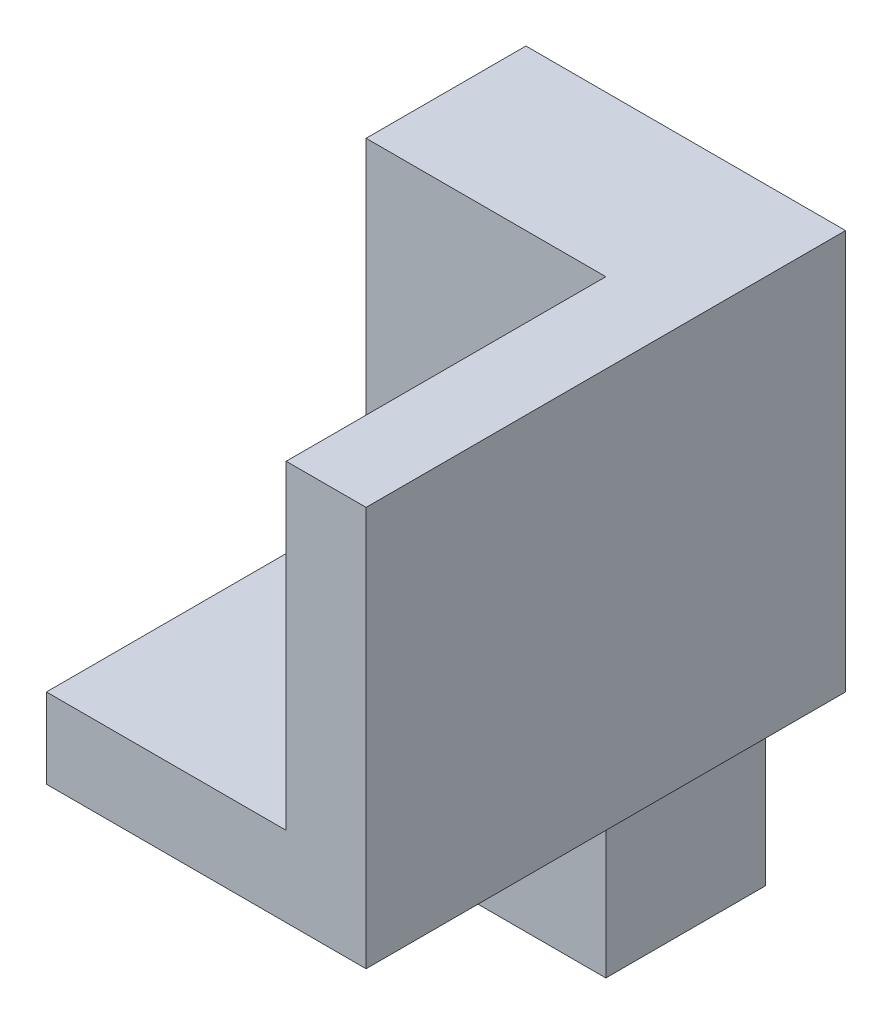
ISO-10303-21;
HEADER;
FILE_DESCRIPTION(('STEP AP214'),'2;1');
FILE_NAME('part.step','',(''),(''),'','','');
FILE_SCHEMA(('AUTOMOTIVE_DESIGN { 1 0 10303 214 1 1 1 1 }'));
ENDSEC;
DATA;
#1=APPLICATION_CONTEXT('core data for automotive mechanical design processes');
#2=APPLICATION_PROTOCOL_DEFINITION('international standard','automotive_design',2000,#1);
#3=PRODUCT_CONTEXT('',#1,'mechanical');
#4=PRODUCT('Part','Part','',(#3));
#5=PRODUCT_RELATED_PRODUCT_CATEGORY('part','',(#4));
#6=PRODUCT_DEFINITION_FORMATION('','',#4);
#7=PRODUCT_DEFINITION_CONTEXT('part definition',#1,'design');
#8=PRODUCT_DEFINITION('design','',#6,#7);
#9=PRODUCT_DEFINITION_SHAPE('','',#8);
#10=(LENGTH_UNIT() NAMED_UNIT(*) SI_UNIT(.MILLI.,.METRE.));
#11=(NAMED_UNIT(*) PLANE_ANGLE_UNIT() SI_UNIT($,.RADIAN.));
#12=(NAMED_UNIT(*) SI_UNIT($,.STERADIAN.) SOLID_ANGLE_UNIT());
#13=UNCERTAINTY_MEASURE_WITH_UNIT(LENGTH_MEASURE(1.E-05),#10,'distance_accuracy_value','');
#14=(GEOMETRIC_REPRESENTATION_CONTEXT(3) GLOBAL_UNCERTAINTY_ASSIGNED_CONTEXT((#13)) GLOBAL_UNIT_ASSIGNED_CONTEXT((#10,
#11,#12)) REPRESENTATION_CONTEXT('',''));
#15=CARTESIAN_POINT('',(0.,0.,0.));
#16=DIRECTION('',(0.,0.,1.));
#17=DIRECTION('',(1.,0.,0.));
#18=AXIS2_PLACEMENT_3D('',#15,#16,#17);
#19=CARTESIAN_POINT('',(0.,0.,0.));
#20=DIRECTION('',(1.,0.,0.));
#21=DIRECTION('',(0.,0.,-1.));
#22=AXIS2_PLACEMENT_3D('',#19,#20,#21);
#23=PLANE('',#22);
#24=DIRECTION('',(0.,0.,1.));
#25=VECTOR('',#24,1.);
#26=CARTESIAN_POINT('',(0.,-25.,30.));
#27=LINE('',#26,#25);
#28=CARTESIAN_POINT('',(0.,-25.,0.));
#29=VERTEX_POINT('',#28);
#30=CARTESIAN_POINT('',(0.,-25.,10.));
#31=VERTEX_POINT('',#30);
#32=EDGE_CURVE('E120',#29,#31,#27,.T.);
#33=ORIENTED_EDGE('',*,*,#32,.F.);
#34=DIRECTION('',(0.,1.,0.));
#35=VECTOR('',#34,1.);
#36=CARTESIAN_POINT('',(0.,-38.,0.));
#37=LINE('',#36,#35);
#38=CARTESIAN_POINT('',(0.,-38.,0.));
#39=VERTEX_POINT('',#38);
#40=EDGE_CURVE('E138',#39,#29,#37,.T.);
#41=ORIENTED_EDGE('',*,*,#40,.F.);
#42=DIRECTION('',(0.,0.,-1.));
#43=VECTOR('',#42,1.);
#44=CARTESIAN_POINT('',(0.,-38.,10.));
#45=LINE('',#44,#43);
#46=CARTESIAN_POINT('',(0.,-38.,10.));
#47=VERTEX_POINT('',#46);
#48=EDGE_CURVE('E85',#47,#39,#45,.T.);
#49=ORIENTED_EDGE('',*,*,#48,.F.);
#50=DIRECTION('',(0.,-1.,0.));
#51=VECTOR('',#50,1.);
#52=CARTESIAN_POINT('',(0.,-25.,10.));
#53=LINE('',#52,#51);
#54=EDGE_CURVE('E79',#31,#47,#53,.T.);
#55=ORIENTED_EDGE('',*,*,#54,.F.);
#56=EDGE_LOOP('',(#33,#41,#49,#55));
#57=FACE_BOUND('',#56,.T.);
#58=ADVANCED_FACE('F45',(#57),#23,.F.);
#59=CARTESIAN_POINT('',(10.,-38.,0.));
#60=DIRECTION('',(0.,0.,1.));
#61=DIRECTION('',(1.,0.,0.));
#62=AXIS2_PLACEMENT_3D('',#59,#60,#61);
#63=PLANE('',#62);
#64=ORIENTED_EDGE('',*,*,#40,.T.);
#65=DIRECTION('',(1.,0.,0.));
#66=VECTOR('',#65,1.);
#67=CARTESIAN_POINT('',(-5.,-25.,0.));
#68=LINE('',#67,#66);
#69=CARTESIAN_POINT('',(-5.,-25.,0.));
#70=VERTEX_POINT('',#69);
#71=EDGE_CURVE('E142',#70,#29,#68,.T.);
#72=ORIENTED_EDGE('',*,*,#71,.F.);
#73=DIRECTION('',(0.,-1.,0.));
#74=VECTOR('',#73,1.);
#75=CARTESIAN_POINT('',(-5.,-25.,0.));
#76=LINE('',#75,#74);
#77=CARTESIAN_POINT('',(-5.,0.,0.));
#78=VERTEX_POINT('',#77);
#79=EDGE_CURVE('E185',#78,#70,#76,.T.);
#80=ORIENTED_EDGE('',*,*,#79,.F.);
#81=DIRECTION('',(-1.,0.,0.));
#82=VECTOR('',#81,1.);
#83=CARTESIAN_POINT('',(10.,0.,0.));
#84=LINE('',#83,#82);
#85=CARTESIAN_POINT('',(15.,0.,0.));
#86=VERTEX_POINT('',#85);
#87=EDGE_CURVE('E49',#86,#78,#84,.T.);
#88=ORIENTED_EDGE('',*,*,#87,.F.);
#89=DIRECTION('',(0.,1.,0.));
#90=VECTOR('',#89,1.);
#91=CARTESIAN_POINT('',(15.,0.,0.));
#92=LINE('',#91,#90);
#93=CARTESIAN_POINT('',(15.,-25.,0.));
#94=VERTEX_POINT('',#93);
#95=EDGE_CURVE('E259',#94,#86,#92,.T.);
#96=ORIENTED_EDGE('',*,*,#95,.F.);
#97=DIRECTION('',(-1.,0.,0.));
#98=VECTOR('',#97,1.);
#99=CARTESIAN_POINT('',(15.,-25.,0.));
#100=LINE('',#99,#98);
#101=CARTESIAN_POINT('',(10.,-25.,0.));
#102=VERTEX_POINT('',#101);
#103=EDGE_CURVE('E263',#94,#102,#100,.T.);
#104=ORIENTED_EDGE('',*,*,#103,.T.);
#105=DIRECTION('',(0.,1.,0.));
#106=VECTOR('',#105,1.);
#107=CARTESIAN_POINT('',(10.,-38.,0.));
#108=LINE('',#107,#106);
#109=CARTESIAN_POINT('',(10.,-38.,0.));
#110=VERTEX_POINT('',#109);
#111=EDGE_CURVE('E111',#110,#102,#108,.T.);
#112=ORIENTED_EDGE('',*,*,#111,.F.);
#113=DIRECTION('',(-1.,0.,0.));
#114=VECTOR('',#113,1.);
#115=CARTESIAN_POINT('',(10.,-38.,0.));
#116=LINE('',#115,#114);
#117=EDGE_CURVE('E131',#110,#39,#116,.T.);
#118=ORIENTED_EDGE('',*,*,#117,.T.);
#119=EDGE_LOOP('',(#64,#72,#80,#88,#96,#104,#112,#118));
#120=FACE_BOUND('',#119,.T.);
#121=ADVANCED_FACE('F47',(#120),#63,.F.);
#122=CARTESIAN_POINT('',(10.,0.,0.));
#123=DIRECTION('',(0.,-1.,0.));
#124=DIRECTION('',(0.,0.,-1.));
#125=AXIS2_PLACEMENT_3D('',#122,#123,#124);
#126=PLANE('',#125);
#127=ORIENTED_EDGE('',*,*,#87,.T.);
#128=DIRECTION('',(0.,0.,-1.));
#129=VECTOR('',#128,1.);
#130=CARTESIAN_POINT('',(-5.,0.,0.));
#131=LINE('',#130,#129);
#132=CARTESIAN_POINT('',(-5.,0.,10.));
#133=VERTEX_POINT('',#132);
#134=EDGE_CURVE('E171',#133,#78,#131,.T.);
#135=ORIENTED_EDGE('',*,*,#134,.F.);
#136=DIRECTION('',(-1.,0.,0.));
#137=VECTOR('',#136,1.);
#138=CARTESIAN_POINT('',(10.,0.,10.));
#139=LINE('',#138,#137);
#140=CARTESIAN_POINT('',(10.,0.,10.));
#141=VERTEX_POINT('',#140);
#142=EDGE_CURVE('E94',#141,#133,#139,.T.);
#143=ORIENTED_EDGE('',*,*,#142,.F.);
#144=DIRECTION('',(0.,0.,1.));
#145=VECTOR('',#144,1.);
#146=CARTESIAN_POINT('',(10.,0.,0.));
#147=LINE('',#146,#145);
#148=CARTESIAN_POINT('',(10.,0.,30.));
#149=VERTEX_POINT('',#148);
#150=EDGE_CURVE('E222',#141,#149,#147,.T.);
#151=ORIENTED_EDGE('',*,*,#150,.T.);
#152=DIRECTION('',(-1.,0.,0.));
#153=VECTOR('',#152,1.);
#154=CARTESIAN_POINT('',(15.,0.,30.));
#155=LINE('',#154,#153);
#156=CARTESIAN_POINT('',(15.,0.,30.));
#157=VERTEX_POINT('',#156);
#158=EDGE_CURVE('E198',#157,#149,#155,.T.);
#159=ORIENTED_EDGE('',*,*,#158,.F.);
#160=DIRECTION('',(0.,0.,1.));
#161=VECTOR('',#160,1.);
#162=CARTESIAN_POINT('',(15.,0.,0.));
#163=LINE('',#162,#161);
#164=EDGE_CURVE('E175',#86,#157,#163,.T.);
#165=ORIENTED_EDGE('',*,*,#164,.F.);
#166=EDGE_LOOP('',(#127,#135,#143,#151,#159,#165));
#167=FACE_BOUND('',#166,.T.);
#168=ADVANCED_FACE('F170',(#167),#126,.F.);
#169=CARTESIAN_POINT('',(10.,0.,10.));
#170=DIRECTION('',(0.,0.,-1.));
#171=DIRECTION('',(0.,1.,0.));
#172=AXIS2_PLACEMENT_3D('',#169,#170,#171);
#173=PLANE('',#172);
#174=ORIENTED_EDGE('',*,*,#142,.T.);
#175=DIRECTION('',(0.,1.,0.));
#176=VECTOR('',#175,1.);
#177=CARTESIAN_POINT('',(-5.,0.,10.));
#178=LINE('',#177,#176);
#179=CARTESIAN_POINT('',(-5.,-20.,10.));
#180=VERTEX_POINT('',#179);
#181=EDGE_CURVE('E188',#180,#133,#178,.T.);
#182=ORIENTED_EDGE('',*,*,#181,.F.);
#183=DIRECTION('',(-1.,0.,0.));
#184=VECTOR('',#183,1.);
#185=CARTESIAN_POINT('',(10.,-20.,10.));
#186=LINE('',#185,#184);
#187=CARTESIAN_POINT('',(10.,-20.,10.));
#188=VERTEX_POINT('',#187);
#189=EDGE_CURVE('E157',#188,#180,#186,.T.);
#190=ORIENTED_EDGE('',*,*,#189,.F.);
#191=DIRECTION('',(0.,-1.,0.));
#192=VECTOR('',#191,1.);
#193=CARTESIAN_POINT('',(10.,0.,10.));
#194=LINE('',#193,#192);
#195=EDGE_CURVE('E134',#141,#188,#194,.T.);
#196=ORIENTED_EDGE('',*,*,#195,.F.);
#197=EDGE_LOOP('',(#174,#182,#190,#196));
#198=FACE_BOUND('',#197,.T.);
#199=ADVANCED_FACE('F223',(#198),#173,.F.);
#200=CARTESIAN_POINT('',(10.,-20.,10.));
#201=DIRECTION('',(0.,-1.,0.));
#202=DIRECTION('',(0.,0.,-1.));
#203=AXIS2_PLACEMENT_3D('',#200,#201,#202);
#204=PLANE('',#203);
#205=ORIENTED_EDGE('',*,*,#189,.T.);
#206=DIRECTION('',(0.,0.,-1.));
#207=VECTOR('',#206,1.);
#208=CARTESIAN_POINT('',(-5.,-20.,10.));
#209=LINE('',#208,#207);
#210=CARTESIAN_POINT('',(-5.,-20.,30.));
#211=VERTEX_POINT('',#210);
#212=EDGE_CURVE('E206',#211,#180,#209,.T.);
#213=ORIENTED_EDGE('',*,*,#212,.F.);
#214=DIRECTION('',(-1.,0.,0.));
#215=VECTOR('',#214,1.);
#216=CARTESIAN_POINT('',(10.,-20.,30.));
#217=LINE('',#216,#215);
#218=CARTESIAN_POINT('',(10.,-20.,30.));
#219=VERTEX_POINT('',#218);
#220=EDGE_CURVE('E153',#219,#211,#217,.T.);
#221=ORIENTED_EDGE('',*,*,#220,.F.);
#222=DIRECTION('',(0.,0.,1.));
#223=VECTOR('',#222,1.);
#224=CARTESIAN_POINT('',(10.,-20.,10.));
#225=LINE('',#224,#223);
#226=EDGE_CURVE('E127',#188,#219,#225,.T.);
#227=ORIENTED_EDGE('',*,*,#226,.F.);
#228=EDGE_LOOP('',(#205,#213,#221,#227));
#229=FACE_BOUND('',#228,.T.);
#230=ADVANCED_FACE('F227',(#229),#204,.F.);
#231=CARTESIAN_POINT('',(10.,-20.,30.));
#232=DIRECTION('',(0.,0.,-1.));
#233=DIRECTION('',(0.,1.,0.));
#234=AXIS2_PLACEMENT_3D('',#231,#232,#233);
#235=PLANE('',#234);
#236=ORIENTED_EDGE('',*,*,#220,.T.);
#237=DIRECTION('',(0.,1.,0.));
#238=VECTOR('',#237,1.);
#239=CARTESIAN_POINT('',(-5.,-20.,30.));
#240=LINE('',#239,#238);
#241=CARTESIAN_POINT('',(-5.,-25.,30.));
#242=VERTEX_POINT('',#241);
#243=EDGE_CURVE('E196',#242,#211,#240,.T.);
#244=ORIENTED_EDGE('',*,*,#243,.F.);
#245=DIRECTION('',(-1.,0.,0.));
#246=VECTOR('',#245,1.);
#247=CARTESIAN_POINT('',(10.,-25.,30.));
#248=LINE('',#247,#246);
#249=CARTESIAN_POINT('',(15.,-25.,30.));
#250=VERTEX_POINT('',#249);
#251=EDGE_CURVE('E122',#250,#242,#248,.T.);
#252=ORIENTED_EDGE('',*,*,#251,.F.);
#253=DIRECTION('',(0.,-1.,0.));
#254=VECTOR('',#253,1.);
#255=CARTESIAN_POINT('',(15.,0.,30.));
#256=LINE('',#255,#254);
#257=EDGE_CURVE('E258',#157,#250,#256,.T.);
#258=ORIENTED_EDGE('',*,*,#257,.F.);
#259=ORIENTED_EDGE('',*,*,#158,.T.);
#260=DIRECTION('',(0.,-1.,0.));
#261=VECTOR('',#260,1.);
#262=CARTESIAN_POINT('',(10.,0.,30.));
#263=LINE('',#262,#261);
#264=EDGE_CURVE('E235',#149,#219,#263,.T.);
#265=ORIENTED_EDGE('',*,*,#264,.T.);
#266=EDGE_LOOP('',(#236,#244,#252,#258,#259,#265));
#267=FACE_BOUND('',#266,.T.);
#268=ADVANCED_FACE('F231',(#267),#235,.F.);
#269=CARTESIAN_POINT('',(10.,-25.,30.));
#270=DIRECTION('',(0.,1.,0.));
#271=DIRECTION('',(0.,0.,1.));
#272=AXIS2_PLACEMENT_3D('',#269,#270,#271);
#273=PLANE('',#272);
#274=ORIENTED_EDGE('',*,*,#251,.T.);
#275=DIRECTION('',(0.,0.,1.));
#276=VECTOR('',#275,1.);
#277=CARTESIAN_POINT('',(-5.,-25.,30.));
#278=LINE('',#277,#276);
#279=EDGE_CURVE('E192',#70,#242,#278,.T.);
#280=ORIENTED_EDGE('',*,*,#279,.F.);
#281=ORIENTED_EDGE('',*,*,#71,.T.);
#282=ORIENTED_EDGE('',*,*,#32,.T.);
#283=DIRECTION('',(-1.,0.,0.));
#284=VECTOR('',#283,1.);
#285=CARTESIAN_POINT('',(10.,-25.,10.));
#286=LINE('',#285,#284);
#287=CARTESIAN_POINT('',(10.,-25.,10.));
#288=VERTEX_POINT('',#287);
#289=EDGE_CURVE('E115',#288,#31,#286,.T.);
#290=ORIENTED_EDGE('',*,*,#289,.F.);
#291=DIRECTION('',(0.,0.,-1.));
#292=VECTOR('',#291,1.);
#293=CARTESIAN_POINT('',(10.,-25.,0.));
#294=LINE('',#293,#292);
#295=EDGE_CURVE('E11',#288,#102,#294,.T.);
#296=ORIENTED_EDGE('',*,*,#295,.T.);
#297=ORIENTED_EDGE('',*,*,#103,.F.);
#298=DIRECTION('',(0.,0.,-1.));
#299=VECTOR('',#298,1.);
#300=CARTESIAN_POINT('',(15.,-25.,0.));
#301=LINE('',#300,#299);
#302=EDGE_CURVE('E265',#250,#94,#301,.T.);
#303=ORIENTED_EDGE('',*,*,#302,.F.);
#304=EDGE_LOOP('',(#274,#280,#281,#282,#290,#296,#297,#303));
#305=FACE_BOUND('',#304,.T.);
#306=ADVANCED_FACE('F117',(#305),#273,.F.);
#307=CARTESIAN_POINT('',(10.,-25.,10.));
#308=DIRECTION('',(0.,0.,-1.));
#309=DIRECTION('',(0.,1.,0.));
#310=AXIS2_PLACEMENT_3D('',#307,#308,#309);
#311=PLANE('',#310);
#312=ORIENTED_EDGE('',*,*,#54,.T.);
#313=DIRECTION('',(-1.,0.,0.));
#314=VECTOR('',#313,1.);
#315=CARTESIAN_POINT('',(10.,-38.,10.));
#316=LINE('',#315,#314);
#317=CARTESIAN_POINT('',(10.,-38.,10.));
#318=VERTEX_POINT('',#317);
#319=EDGE_CURVE('E123',#318,#47,#316,.T.);
#320=ORIENTED_EDGE('',*,*,#319,.F.);
#321=DIRECTION('',(0.,-1.,0.));
#322=VECTOR('',#321,1.);
#323=CARTESIAN_POINT('',(10.,-25.,10.));
#324=LINE('',#323,#322);
#325=EDGE_CURVE('E108',#288,#318,#324,.T.);
#326=ORIENTED_EDGE('',*,*,#325,.F.);
#327=ORIENTED_EDGE('',*,*,#289,.T.);
#328=EDGE_LOOP('',(#312,#320,#326,#327));
#329=FACE_BOUND('',#328,.T.);
#330=ADVANCED_FACE('F125',(#329),#311,.F.);
#331=CARTESIAN_POINT('',(10.,-38.,10.));
#332=DIRECTION('',(0.,1.,0.));
#333=DIRECTION('',(0.,0.,1.));
#334=AXIS2_PLACEMENT_3D('',#331,#332,#333);
#335=PLANE('',#334);
#336=ORIENTED_EDGE('',*,*,#48,.T.);
#337=ORIENTED_EDGE('',*,*,#117,.F.);
#338=DIRECTION('',(0.,0.,-1.));
#339=VECTOR('',#338,1.);
#340=CARTESIAN_POINT('',(10.,-38.,10.));
#341=LINE('',#340,#339);
#342=EDGE_CURVE('E64',#318,#110,#341,.T.);
#343=ORIENTED_EDGE('',*,*,#342,.F.);
#344=ORIENTED_EDGE('',*,*,#319,.T.);
#345=EDGE_LOOP('',(#336,#337,#343,#344));
#346=FACE_BOUND('',#345,.T.);
#347=ADVANCED_FACE('F288',(#346),#335,.F.);
#348=CARTESIAN_POINT('',(10.,0.,0.));
#349=DIRECTION('',(1.,0.,0.));
#350=DIRECTION('',(0.,0.,-1.));
#351=AXIS2_PLACEMENT_3D('',#348,#349,#350);
#352=PLANE('',#351);
#353=ORIENTED_EDGE('',*,*,#295,.F.);
#354=ORIENTED_EDGE('',*,*,#325,.T.);
#355=ORIENTED_EDGE('',*,*,#342,.T.);
#356=ORIENTED_EDGE('',*,*,#111,.T.);
#357=EDGE_LOOP('',(#353,#354,#355,#356));
#358=FACE_BOUND('',#357,.T.);
#359=ADVANCED_FACE('F106',(#358),#352,.T.);
#360=CARTESIAN_POINT('',(-5.,0.,0.));
#361=DIRECTION('',(1.,0.,0.));
#362=DIRECTION('',(0.,0.,-1.));
#363=AXIS2_PLACEMENT_3D('',#360,#361,#362);
#364=PLANE('',#363);
#365=ORIENTED_EDGE('',*,*,#79,.T.);
#366=ORIENTED_EDGE('',*,*,#279,.T.);
#367=ORIENTED_EDGE('',*,*,#243,.T.);
#368=ORIENTED_EDGE('',*,*,#212,.T.);
#369=ORIENTED_EDGE('',*,*,#181,.T.);
#370=ORIENTED_EDGE('',*,*,#134,.T.);
#371=EDGE_LOOP('',(#365,#366,#367,#368,#369,#370));
#372=FACE_BOUND('',#371,.T.);
#373=ADVANCED_FACE('F182',(#372),#364,.F.);
#374=CARTESIAN_POINT('',(15.,0.,0.));
#375=DIRECTION('',(-1.,0.,0.));
#376=DIRECTION('',(0.,0.,1.));
#377=AXIS2_PLACEMENT_3D('',#374,#375,#376);
#378=PLANE('',#377);
#379=ORIENTED_EDGE('',*,*,#95,.T.);
#380=ORIENTED_EDGE('',*,*,#164,.T.);
#381=ORIENTED_EDGE('',*,*,#257,.T.);
#382=ORIENTED_EDGE('',*,*,#302,.T.);
#383=EDGE_LOOP('',(#379,#380,#381,#382));
#384=FACE_BOUND('',#383,.T.);
#385=ADVANCED_FACE('F256',(#384),#378,.F.);
#386=CARTESIAN_POINT('',(10.,0.,0.));
#387=DIRECTION('',(-1.,0.,0.));
#388=DIRECTION('',(0.,0.,1.));
#389=AXIS2_PLACEMENT_3D('',#386,#387,#388);
#390=PLANE('',#389);
#391=ORIENTED_EDGE('',*,*,#150,.F.);
#392=ORIENTED_EDGE('',*,*,#195,.T.);
#393=ORIENTED_EDGE('',*,*,#226,.T.);
#394=ORIENTED_EDGE('',*,*,#264,.F.);
#395=EDGE_LOOP('',(#391,#392,#393,#394));
#396=FACE_BOUND('',#395,.T.);
#397=ADVANCED_FACE('F218',(#396),#390,.T.);
#398=CLOSED_SHELL('',(#58,#121,#168,#199,#230,#268,#306,#330,#347,#359,#373,#385,#397));
#399=MANIFOLD_SOLID_BREP('B2',#398);
#400=ADVANCED_BREP_SHAPE_REPRESENTATION('',(#18,#399),#14);
#401=SHAPE_DEFINITION_REPRESENTATION(#9,#400);
ENDSEC;
END-ISO-10303-21;
